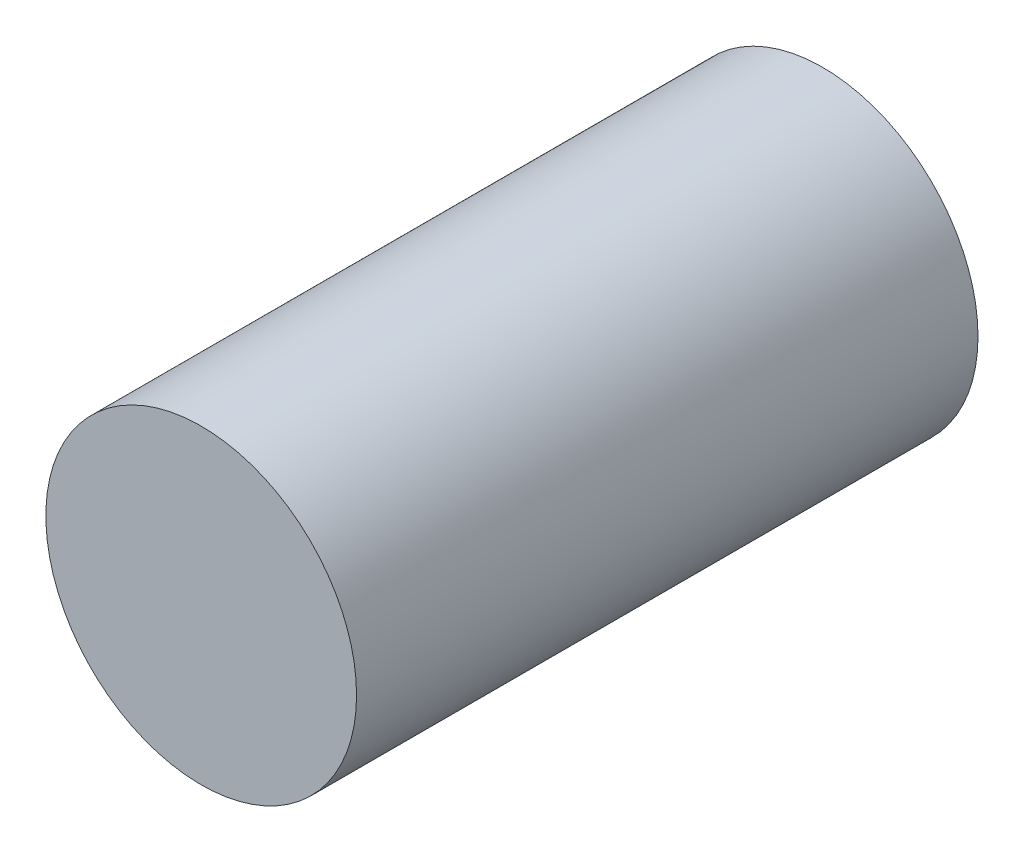
ISO-10303-21;
HEADER;
FILE_DESCRIPTION(('STEP AP214'),'2;1');
FILE_NAME('part.step','',(''),(''),'','','');
FILE_SCHEMA(('AUTOMOTIVE_DESIGN { 1 0 10303 214 1 1 1 1 }'));
ENDSEC;
DATA;
#1=APPLICATION_CONTEXT('core data for automotive mechanical design processes');
#2=APPLICATION_PROTOCOL_DEFINITION('international standard','automotive_design',2000,#1);
#3=PRODUCT_CONTEXT('',#1,'mechanical');
#4=PRODUCT('Part','Part','',(#3));
#5=PRODUCT_RELATED_PRODUCT_CATEGORY('part','',(#4));
#6=PRODUCT_DEFINITION_FORMATION('','',#4);
#7=PRODUCT_DEFINITION_CONTEXT('part definition',#1,'design');
#8=PRODUCT_DEFINITION('design','',#6,#7);
#9=PRODUCT_DEFINITION_SHAPE('','',#8);
#10=(LENGTH_UNIT() NAMED_UNIT(*) SI_UNIT(.MILLI.,.METRE.));
#11=(NAMED_UNIT(*) PLANE_ANGLE_UNIT() SI_UNIT($,.RADIAN.));
#12=(NAMED_UNIT(*) SI_UNIT($,.STERADIAN.) SOLID_ANGLE_UNIT());
#13=UNCERTAINTY_MEASURE_WITH_UNIT(LENGTH_MEASURE(1.E-05),#10,'distance_accuracy_value','');
#14=(GEOMETRIC_REPRESENTATION_CONTEXT(3) GLOBAL_UNCERTAINTY_ASSIGNED_CONTEXT((#13)) GLOBAL_UNIT_ASSIGNED_CONTEXT((#10,
#11,#12)) REPRESENTATION_CONTEXT('',''));
#15=CARTESIAN_POINT('',(0.,0.,0.));
#16=DIRECTION('',(0.,0.,1.));
#17=DIRECTION('',(1.,0.,0.));
#18=AXIS2_PLACEMENT_3D('',#15,#16,#17);
#19=CARTESIAN_POINT('',(0.,0.,12.));
#20=DIRECTION('',(0.,0.,-1.));
#21=DIRECTION('',(-1.,0.,0.));
#22=AXIS2_PLACEMENT_3D('',#19,#20,#21);
#23=CYLINDRICAL_SURFACE('',#22,3.);
#24=CARTESIAN_POINT('',(0.,0.,12.));
#25=DIRECTION('',(0.,0.,1.));
#26=DIRECTION('',(1.,0.,0.));
#27=AXIS2_PLACEMENT_3D('',#24,#25,#26);
#28=CIRCLE('',#27,3.);
#29=CARTESIAN_POINT('',(3.,0.,12.));
#30=VERTEX_POINT('',#29);
#31=EDGE_CURVE('E10',#30,#30,#28,.T.);
#32=ORIENTED_EDGE('',*,*,#31,.F.);
#33=EDGE_LOOP('',(#32));
#34=FACE_BOUND('',#33,.T.);
#35=CARTESIAN_POINT('',(0.,0.,0.));
#36=DIRECTION('',(0.,0.,1.));
#37=DIRECTION('',(1.,0.,0.));
#38=AXIS2_PLACEMENT_3D('',#35,#36,#37);
#39=CIRCLE('',#38,3.);
#40=CARTESIAN_POINT('',(3.,0.,0.));
#41=VERTEX_POINT('',#40);
#42=EDGE_CURVE('E40',#41,#41,#39,.T.);
#43=ORIENTED_EDGE('',*,*,#42,.T.);
#44=EDGE_LOOP('',(#43));
#45=FACE_BOUND('',#44,.T.);
#46=ADVANCED_FACE('F37',(#34,#45),#23,.T.);
#47=CARTESIAN_POINT('',(0.,0.,12.));
#48=DIRECTION('',(0.,0.,1.));
#49=DIRECTION('',(1.,0.,0.));
#50=AXIS2_PLACEMENT_3D('',#47,#48,#49);
#51=PLANE('',#50);
#52=ORIENTED_EDGE('',*,*,#31,.T.);
#53=EDGE_LOOP('',(#52));
#54=FACE_BOUND('',#53,.T.);
#55=ADVANCED_FACE('F54',(#54),#51,.T.);
#56=CARTESIAN_POINT('',(0.,0.,0.));
#57=DIRECTION('',(0.,0.,1.));
#58=DIRECTION('',(1.,0.,0.));
#59=AXIS2_PLACEMENT_3D('',#56,#57,#58);
#60=PLANE('',#59);
#61=ORIENTED_EDGE('',*,*,#42,.F.);
#62=EDGE_LOOP('',(#61));
#63=FACE_BOUND('',#62,.T.);
#64=ADVANCED_FACE('F52',(#63),#60,.F.);
#65=CLOSED_SHELL('',(#46,#55,#64));
#66=MANIFOLD_SOLID_BREP('B2',#65);
#67=ADVANCED_BREP_SHAPE_REPRESENTATION('',(#18,#66),#14);
#68=SHAPE_DEFINITION_REPRESENTATION(#9,#67);
ENDSEC;
END-ISO-10303-21;
